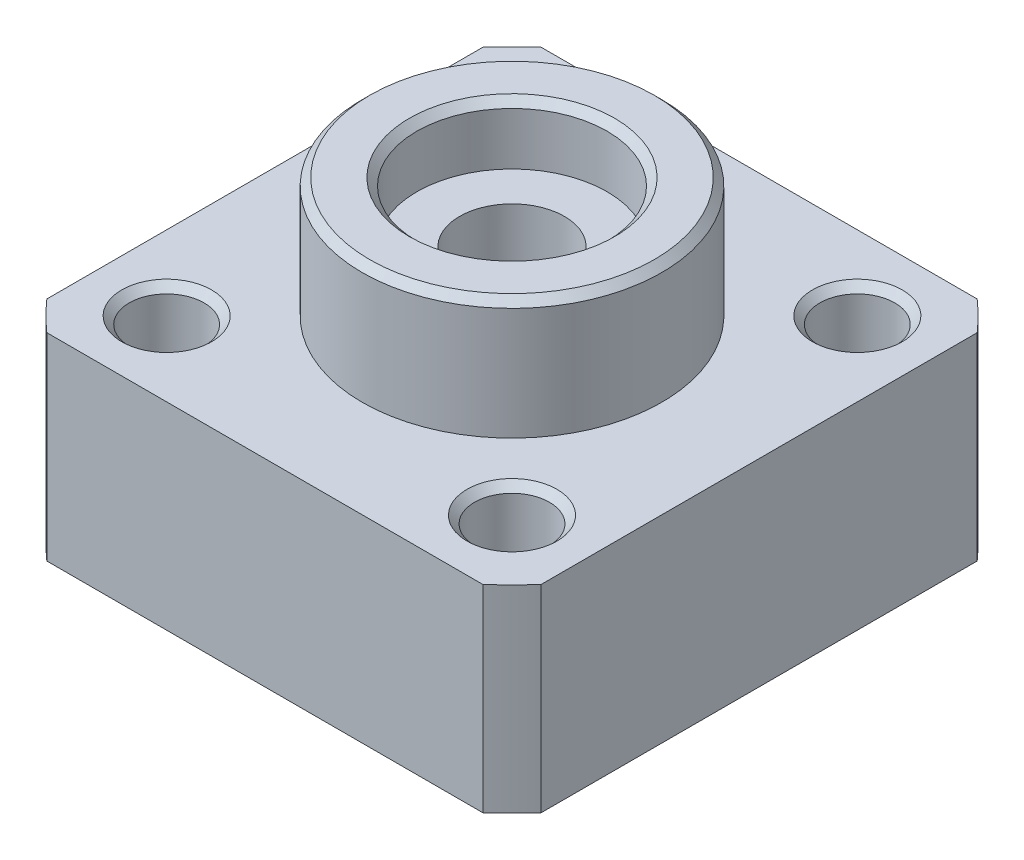
ISO-10303-21;
HEADER;
FILE_DESCRIPTION(('STEP AP214'),'2;1');
FILE_NAME('part.step','',(''),(''),'','','');
FILE_SCHEMA(('AUTOMOTIVE_DESIGN { 1 0 10303 214 1 1 1 1 }'));
ENDSEC;
DATA;
#1=APPLICATION_CONTEXT('core data for automotive mechanical design processes');
#2=APPLICATION_PROTOCOL_DEFINITION('international standard','automotive_design',2000,#1);
#3=PRODUCT_CONTEXT('',#1,'mechanical');
#4=PRODUCT('Part','Part','',(#3));
#5=PRODUCT_RELATED_PRODUCT_CATEGORY('part','',(#4));
#6=PRODUCT_DEFINITION_FORMATION('','',#4);
#7=PRODUCT_DEFINITION_CONTEXT('part definition',#1,'design');
#8=PRODUCT_DEFINITION('design','',#6,#7);
#9=PRODUCT_DEFINITION_SHAPE('','',#8);
#10=(LENGTH_UNIT() NAMED_UNIT(*) SI_UNIT(.MILLI.,.METRE.));
#11=(NAMED_UNIT(*) PLANE_ANGLE_UNIT() SI_UNIT($,.RADIAN.));
#12=(NAMED_UNIT(*) SI_UNIT($,.STERADIAN.) SOLID_ANGLE_UNIT());
#13=UNCERTAINTY_MEASURE_WITH_UNIT(LENGTH_MEASURE(1.E-05),#10,'distance_accuracy_value','');
#14=(GEOMETRIC_REPRESENTATION_CONTEXT(3) GLOBAL_UNCERTAINTY_ASSIGNED_CONTEXT((#13)) GLOBAL_UNIT_ASSIGNED_CONTEXT((#10,
#11,#12)) REPRESENTATION_CONTEXT('',''));
#15=CARTESIAN_POINT('',(0.,0.,0.));
#16=DIRECTION('',(0.,0.,1.));
#17=DIRECTION('',(1.,0.,0.));
#18=AXIS2_PLACEMENT_3D('',#15,#16,#17);
#19=CARTESIAN_POINT('',(-22.,13.2,0.));
#20=DIRECTION('',(0.,-1.,0.));
#21=DIRECTION('',(0.,0.,-1.));
#22=AXIS2_PLACEMENT_3D('',#19,#20,#21);
#23=PLANE('',#22);
#24=CARTESIAN_POINT('',(-11.5258405333407,13.2,11.5258405333407));
#25=DIRECTION('',(0.,-1.,0.));
#26=DIRECTION('',(0.,0.,-1.));
#27=AXIS2_PLACEMENT_3D('',#24,#25,#26);
#28=CIRCLE('',#27,3.);
#29=CARTESIAN_POINT('',(-11.5258405333407,13.2,8.52584053334072));
#30=VERTEX_POINT('',#29);
#31=EDGE_CURVE('E306',#30,#30,#28,.T.);
#32=ORIENTED_EDGE('',*,*,#31,.T.);
#33=EDGE_LOOP('',(#32));
#34=FACE_BOUND('',#33,.T.);
#35=CARTESIAN_POINT('',(-11.5258405333407,13.2,-11.5258405333407));
#36=DIRECTION('',(0.,-1.,0.));
#37=DIRECTION('',(0.,0.,-1.));
#38=AXIS2_PLACEMENT_3D('',#35,#36,#37);
#39=CIRCLE('',#38,3.);
#40=CARTESIAN_POINT('',(-11.5258405333407,13.2,-14.5258405333407));
#41=VERTEX_POINT('',#40);
#42=EDGE_CURVE('E308',#41,#41,#39,.T.);
#43=ORIENTED_EDGE('',*,*,#42,.T.);
#44=EDGE_LOOP('',(#43));
#45=FACE_BOUND('',#44,.T.);
#46=CARTESIAN_POINT('',(11.5258405333407,13.2,-11.5258405333407));
#47=DIRECTION('',(0.,-1.,0.));
#48=DIRECTION('',(0.,0.,-1.));
#49=AXIS2_PLACEMENT_3D('',#46,#47,#48);
#50=CIRCLE('',#49,3.);
#51=CARTESIAN_POINT('',(11.5258405333407,13.2,-14.5258405333407));
#52=VERTEX_POINT('',#51);
#53=EDGE_CURVE('E311',#52,#52,#50,.T.);
#54=ORIENTED_EDGE('',*,*,#53,.T.);
#55=EDGE_LOOP('',(#54));
#56=FACE_BOUND('',#55,.T.);
#57=CARTESIAN_POINT('',(11.5258405333407,13.2,11.5258405333407));
#58=DIRECTION('',(0.,-1.,0.));
#59=DIRECTION('',(0.,0.,-1.));
#60=AXIS2_PLACEMENT_3D('',#57,#58,#59);
#61=CIRCLE('',#60,3.);
#62=CARTESIAN_POINT('',(11.5258405333407,13.2,8.52584053334072));
#63=VERTEX_POINT('',#62);
#64=EDGE_CURVE('E314',#63,#63,#61,.T.);
#65=ORIENTED_EDGE('',*,*,#64,.T.);
#66=EDGE_LOOP('',(#65));
#67=FACE_BOUND('',#66,.T.);
#68=CARTESIAN_POINT('',(0.,13.2,0.));
#69=DIRECTION('',(0.,-1.,0.));
#70=DIRECTION('',(0.,0.,-1.));
#71=AXIS2_PLACEMENT_3D('',#68,#69,#70);
#72=CIRCLE('',#71,10.);
#73=CARTESIAN_POINT('',(0.,13.2,-10.));
#74=VERTEX_POINT('',#73);
#75=EDGE_CURVE('E114',#74,#74,#72,.T.);
#76=ORIENTED_EDGE('',*,*,#75,.T.);
#77=EDGE_LOOP('',(#76));
#78=FACE_BOUND('',#77,.T.);
#79=DIRECTION('',(0.,0.,-1.));
#80=VECTOR('',#79,1.);
#81=CARTESIAN_POINT('',(-16.5,13.2,0.));
#82=LINE('',#81,#80);
#83=CARTESIAN_POINT('',(-16.5,13.2,14.5516322108553));
#84=VERTEX_POINT('',#83);
#85=CARTESIAN_POINT('',(-16.5,13.2,-14.5516322108553));
#86=VERTEX_POINT('',#85);
#87=EDGE_CURVE('E165',#84,#86,#82,.T.);
#88=ORIENTED_EDGE('',*,*,#87,.F.);
#89=CARTESIAN_POINT('',(0.,13.2,0.));
#90=DIRECTION('',(0.,-1.,0.));
#91=DIRECTION('',(0.,0.,-1.));
#92=AXIS2_PLACEMENT_3D('',#89,#90,#91);
#93=CIRCLE('',#92,22.);
#94=CARTESIAN_POINT('',(-14.5516322108552,13.2,16.5));
#95=VERTEX_POINT('',#94);
#96=EDGE_CURVE('E139',#95,#84,#93,.T.);
#97=ORIENTED_EDGE('',*,*,#96,.F.);
#98=DIRECTION('',(-1.,0.,0.));
#99=VECTOR('',#98,1.);
#100=CARTESIAN_POINT('',(-22.,13.2,16.5));
#101=LINE('',#100,#99);
#102=CARTESIAN_POINT('',(14.5516322108552,13.2,16.5));
#103=VERTEX_POINT('',#102);
#104=EDGE_CURVE('E155',#103,#95,#101,.T.);
#105=ORIENTED_EDGE('',*,*,#104,.F.);
#106=CARTESIAN_POINT('',(16.5,13.2,14.5516322108552));
#107=VERTEX_POINT('',#106);
#108=EDGE_CURVE('E153',#107,#103,#93,.T.);
#109=ORIENTED_EDGE('',*,*,#108,.F.);
#110=DIRECTION('',(0.,0.,1.));
#111=VECTOR('',#110,1.);
#112=CARTESIAN_POINT('',(16.5,13.2,0.));
#113=LINE('',#112,#111);
#114=CARTESIAN_POINT('',(16.5,13.2,-14.5516322108552));
#115=VERTEX_POINT('',#114);
#116=EDGE_CURVE('E158',#115,#107,#113,.T.);
#117=ORIENTED_EDGE('',*,*,#116,.F.);
#118=CARTESIAN_POINT('',(14.5516322108552,13.2,-16.5));
#119=VERTEX_POINT('',#118);
#120=EDGE_CURVE('E140',#119,#115,#93,.T.);
#121=ORIENTED_EDGE('',*,*,#120,.F.);
#122=DIRECTION('',(1.,0.,0.));
#123=VECTOR('',#122,1.);
#124=CARTESIAN_POINT('',(-22.,13.2,-16.5));
#125=LINE('',#124,#123);
#126=CARTESIAN_POINT('',(-14.5516322108552,13.2,-16.5));
#127=VERTEX_POINT('',#126);
#128=EDGE_CURVE('E123',#127,#119,#125,.T.);
#129=ORIENTED_EDGE('',*,*,#128,.F.);
#130=EDGE_CURVE('E122',#86,#127,#93,.T.);
#131=ORIENTED_EDGE('',*,*,#130,.F.);
#132=EDGE_LOOP('',(#88,#97,#105,#109,#117,#121,#129,#131));
#133=FACE_BOUND('',#132,.T.);
#134=ADVANCED_FACE('F38',(#34,#45,#56,#67,#78,#133),#23,.F.);
#135=CARTESIAN_POINT('',(0.,0.,0.));
#136=DIRECTION('',(0.,-1.,0.));
#137=DIRECTION('',(0.,0.,-1.));
#138=AXIS2_PLACEMENT_3D('',#135,#136,#137);
#139=CYLINDRICAL_SURFACE('',#138,22.);
#140=DIRECTION('',(0.,-1.,0.));
#141=VECTOR('',#140,1.);
#142=CARTESIAN_POINT('',(-16.5,0.,-14.5516322108553));
#143=LINE('',#142,#141);
#144=CARTESIAN_POINT('',(-16.5,0.,-14.5516322108553));
#145=VERTEX_POINT('',#144);
#146=EDGE_CURVE('E53',#86,#145,#143,.T.);
#147=ORIENTED_EDGE('',*,*,#146,.F.);
#148=ORIENTED_EDGE('',*,*,#130,.T.);
#149=DIRECTION('',(0.,-1.,0.));
#150=VECTOR('',#149,1.);
#151=CARTESIAN_POINT('',(-14.5516322108552,0.,-16.5));
#152=LINE('',#151,#150);
#153=CARTESIAN_POINT('',(-14.5516322108552,0.,-16.5));
#154=VERTEX_POINT('',#153);
#155=EDGE_CURVE('E105',#154,#127,#152,.F.);
#156=ORIENTED_EDGE('',*,*,#155,.F.);
#157=CARTESIAN_POINT('',(0.,0.,0.));
#158=DIRECTION('',(0.,-1.,0.));
#159=DIRECTION('',(0.,0.,-1.));
#160=AXIS2_PLACEMENT_3D('',#157,#158,#159);
#161=CIRCLE('',#160,22.);
#162=EDGE_CURVE('E120',#145,#154,#161,.T.);
#163=ORIENTED_EDGE('',*,*,#162,.F.);
#164=EDGE_LOOP('',(#147,#148,#156,#163));
#165=FACE_BOUND('',#164,.T.);
#166=ADVANCED_FACE('F119',(#165),#139,.T.);
#167=DIRECTION('',(0.,-1.,0.));
#168=VECTOR('',#167,1.);
#169=CARTESIAN_POINT('',(-16.5,0.,14.5516322108553));
#170=LINE('',#169,#168);
#171=CARTESIAN_POINT('',(-16.5,0.,14.5516322108553));
#172=VERTEX_POINT('',#171);
#173=EDGE_CURVE('E163',#172,#84,#170,.F.);
#174=ORIENTED_EDGE('',*,*,#173,.F.);
#175=CARTESIAN_POINT('',(-14.5516322108552,0.,16.5));
#176=VERTEX_POINT('',#175);
#177=EDGE_CURVE('E129',#176,#172,#161,.T.);
#178=ORIENTED_EDGE('',*,*,#177,.F.);
#179=DIRECTION('',(0.,-1.,0.));
#180=VECTOR('',#179,1.);
#181=CARTESIAN_POINT('',(-14.5516322108552,0.,16.5));
#182=LINE('',#181,#180);
#183=EDGE_CURVE('E61',#95,#176,#182,.T.);
#184=ORIENTED_EDGE('',*,*,#183,.F.);
#185=ORIENTED_EDGE('',*,*,#96,.T.);
#186=EDGE_LOOP('',(#174,#178,#184,#185));
#187=FACE_BOUND('',#186,.T.);
#188=ADVANCED_FACE('F199',(#187),#139,.T.);
#189=DIRECTION('',(0.,-1.,0.));
#190=VECTOR('',#189,1.);
#191=CARTESIAN_POINT('',(14.5516322108552,0.,16.5));
#192=LINE('',#191,#190);
#193=CARTESIAN_POINT('',(14.5516322108552,0.,16.5));
#194=VERTEX_POINT('',#193);
#195=EDGE_CURVE('E152',#194,#103,#192,.F.);
#196=ORIENTED_EDGE('',*,*,#195,.F.);
#197=CARTESIAN_POINT('',(16.5,0.,14.5516322108553));
#198=VERTEX_POINT('',#197);
#199=EDGE_CURVE('E133',#198,#194,#161,.T.);
#200=ORIENTED_EDGE('',*,*,#199,.F.);
#201=DIRECTION('',(0.,-1.,0.));
#202=VECTOR('',#201,1.);
#203=CARTESIAN_POINT('',(16.5,0.,14.5516322108552));
#204=LINE('',#203,#202);
#205=EDGE_CURVE('E150',#107,#198,#204,.T.);
#206=ORIENTED_EDGE('',*,*,#205,.F.);
#207=ORIENTED_EDGE('',*,*,#108,.T.);
#208=EDGE_LOOP('',(#196,#200,#206,#207));
#209=FACE_BOUND('',#208,.T.);
#210=ADVANCED_FACE('F148',(#209),#139,.T.);
#211=DIRECTION('',(0.,-1.,0.));
#212=VECTOR('',#211,1.);
#213=CARTESIAN_POINT('',(16.5,0.,-14.5516322108552));
#214=LINE('',#213,#212);
#215=CARTESIAN_POINT('',(16.5,0.,-14.5516322108552));
#216=VERTEX_POINT('',#215);
#217=EDGE_CURVE('E382',#216,#115,#214,.F.);
#218=ORIENTED_EDGE('',*,*,#217,.F.);
#219=CARTESIAN_POINT('',(14.5516322108552,0.,-16.5));
#220=VERTEX_POINT('',#219);
#221=EDGE_CURVE('E132',#220,#216,#161,.T.);
#222=ORIENTED_EDGE('',*,*,#221,.F.);
#223=DIRECTION('',(0.,-1.,0.));
#224=VECTOR('',#223,1.);
#225=CARTESIAN_POINT('',(14.5516322108552,0.,-16.5));
#226=LINE('',#225,#224);
#227=EDGE_CURVE('E108',#119,#220,#226,.T.);
#228=ORIENTED_EDGE('',*,*,#227,.F.);
#229=ORIENTED_EDGE('',*,*,#120,.T.);
#230=EDGE_LOOP('',(#218,#222,#228,#229));
#231=FACE_BOUND('',#230,.T.);
#232=ADVANCED_FACE('F201',(#231),#139,.T.);
#233=CARTESIAN_POINT('',(-3.5,0.,0.));
#234=DIRECTION('',(0.,1.,0.));
#235=DIRECTION('',(0.,0.,1.));
#236=AXIS2_PLACEMENT_3D('',#233,#234,#235);
#237=PLANE('',#236);
#238=CARTESIAN_POINT('',(-11.5258405333407,0.,11.5258405333407));
#239=DIRECTION('',(0.,1.,0.));
#240=DIRECTION('',(0.,0.,1.));
#241=AXIS2_PLACEMENT_3D('',#238,#239,#240);
#242=CIRCLE('',#241,3.);
#243=CARTESIAN_POINT('',(-11.5258405333407,0.,14.5258405333407));
#244=VERTEX_POINT('',#243);
#245=EDGE_CURVE('E285',#244,#244,#242,.T.);
#246=ORIENTED_EDGE('',*,*,#245,.T.);
#247=EDGE_LOOP('',(#246));
#248=FACE_BOUND('',#247,.T.);
#249=CARTESIAN_POINT('',(-11.5258405333407,0.,-11.5258405333407));
#250=DIRECTION('',(0.,1.,0.));
#251=DIRECTION('',(0.,0.,1.));
#252=AXIS2_PLACEMENT_3D('',#249,#250,#251);
#253=CIRCLE('',#252,3.00000000000002);
#254=CARTESIAN_POINT('',(-11.5258405333407,0.,-8.52584053334071));
#255=VERTEX_POINT('',#254);
#256=EDGE_CURVE('E288',#255,#255,#253,.T.);
#257=ORIENTED_EDGE('',*,*,#256,.T.);
#258=EDGE_LOOP('',(#257));
#259=FACE_BOUND('',#258,.T.);
#260=CARTESIAN_POINT('',(11.5258405333407,0.,-11.5258405333407));
#261=DIRECTION('',(0.,1.,0.));
#262=DIRECTION('',(0.,0.,1.));
#263=AXIS2_PLACEMENT_3D('',#260,#261,#262);
#264=CIRCLE('',#263,3.00000000000002);
#265=CARTESIAN_POINT('',(11.5258405333407,0.,-8.52584053334071));
#266=VERTEX_POINT('',#265);
#267=EDGE_CURVE('E291',#266,#266,#264,.T.);
#268=ORIENTED_EDGE('',*,*,#267,.T.);
#269=EDGE_LOOP('',(#268));
#270=FACE_BOUND('',#269,.T.);
#271=CARTESIAN_POINT('',(11.5258405333407,0.,11.5258405333407));
#272=DIRECTION('',(0.,1.,0.));
#273=DIRECTION('',(0.,0.,1.));
#274=AXIS2_PLACEMENT_3D('',#271,#272,#273);
#275=CIRCLE('',#274,3.);
#276=CARTESIAN_POINT('',(11.5258405333407,0.,14.5258405333407));
#277=VERTEX_POINT('',#276);
#278=EDGE_CURVE('E294',#277,#277,#275,.T.);
#279=ORIENTED_EDGE('',*,*,#278,.T.);
#280=EDGE_LOOP('',(#279));
#281=FACE_BOUND('',#280,.T.);
#282=CARTESIAN_POINT('',(0.,0.,0.));
#283=DIRECTION('',(0.,1.,0.));
#284=DIRECTION('',(0.,0.,1.));
#285=AXIS2_PLACEMENT_3D('',#282,#283,#284);
#286=CIRCLE('',#285,4.);
#287=CARTESIAN_POINT('',(0.,0.,4.));
#288=VERTEX_POINT('',#287);
#289=EDGE_CURVE('E297',#288,#288,#286,.T.);
#290=ORIENTED_EDGE('',*,*,#289,.T.);
#291=EDGE_LOOP('',(#290));
#292=FACE_BOUND('',#291,.T.);
#293=DIRECTION('',(0.,0.,1.));
#294=VECTOR('',#293,1.);
#295=CARTESIAN_POINT('',(-16.5,0.,0.));
#296=LINE('',#295,#294);
#297=EDGE_CURVE('E128',#145,#172,#296,.T.);
#298=ORIENTED_EDGE('',*,*,#297,.F.);
#299=ORIENTED_EDGE('',*,*,#162,.T.);
#300=DIRECTION('',(-1.,0.,0.));
#301=VECTOR('',#300,1.);
#302=CARTESIAN_POINT('',(-3.5,0.,-16.5));
#303=LINE('',#302,#301);
#304=EDGE_CURVE('E102',#220,#154,#303,.T.);
#305=ORIENTED_EDGE('',*,*,#304,.F.);
#306=ORIENTED_EDGE('',*,*,#221,.T.);
#307=DIRECTION('',(0.,0.,-1.));
#308=VECTOR('',#307,1.);
#309=CARTESIAN_POINT('',(16.5,0.,0.));
#310=LINE('',#309,#308);
#311=EDGE_CURVE('E113',#198,#216,#310,.T.);
#312=ORIENTED_EDGE('',*,*,#311,.F.);
#313=ORIENTED_EDGE('',*,*,#199,.T.);
#314=DIRECTION('',(1.,0.,0.));
#315=VECTOR('',#314,1.);
#316=CARTESIAN_POINT('',(-3.5,0.,16.5));
#317=LINE('',#316,#315);
#318=EDGE_CURVE('E143',#176,#194,#317,.T.);
#319=ORIENTED_EDGE('',*,*,#318,.F.);
#320=ORIENTED_EDGE('',*,*,#177,.T.);
#321=EDGE_LOOP('',(#298,#299,#305,#306,#312,#313,#319,#320));
#322=FACE_BOUND('',#321,.T.);
#323=ADVANCED_FACE('F126',(#248,#259,#270,#281,#292,#322),#237,.F.);
#324=CARTESIAN_POINT('',(0.,0.,0.));
#325=DIRECTION('',(0.,-1.,0.));
#326=DIRECTION('',(0.,0.,-1.));
#327=AXIS2_PLACEMENT_3D('',#324,#325,#326);
#328=CYLINDRICAL_SURFACE('',#327,6.35);
#329=CARTESIAN_POINT('',(0.,20.7,0.));
#330=DIRECTION('',(0.,-1.,0.));
#331=DIRECTION('',(0.,0.,-1.));
#332=AXIS2_PLACEMENT_3D('',#329,#330,#331);
#333=CIRCLE('',#332,6.35);
#334=CARTESIAN_POINT('',(0.,20.7,-6.35));
#335=VERTEX_POINT('',#334);
#336=EDGE_CURVE('E46',#335,#335,#333,.F.);
#337=ORIENTED_EDGE('',*,*,#336,.T.);
#338=EDGE_LOOP('',(#337));
#339=FACE_BOUND('',#338,.T.);
#340=CARTESIAN_POINT('',(0.,17.2,0.));
#341=DIRECTION('',(0.,-1.,0.));
#342=DIRECTION('',(0.,0.,-1.));
#343=AXIS2_PLACEMENT_3D('',#340,#341,#342);
#344=CIRCLE('',#343,6.35);
#345=CARTESIAN_POINT('',(0.,17.2,-6.35));
#346=VERTEX_POINT('',#345);
#347=EDGE_CURVE('E135',#346,#346,#344,.T.);
#348=ORIENTED_EDGE('',*,*,#347,.T.);
#349=EDGE_LOOP('',(#348));
#350=FACE_BOUND('',#349,.T.);
#351=ADVANCED_FACE('F171',(#339,#350),#328,.F.);
#352=CARTESIAN_POINT('',(-10.,21.2,0.));
#353=DIRECTION('',(0.,-1.,0.));
#354=DIRECTION('',(0.,0.,-1.));
#355=AXIS2_PLACEMENT_3D('',#352,#353,#354);
#356=PLANE('',#355);
#357=CARTESIAN_POINT('',(0.,21.2,0.));
#358=DIRECTION('',(0.,-1.,0.));
#359=DIRECTION('',(0.,0.,-1.));
#360=AXIS2_PLACEMENT_3D('',#357,#358,#359);
#361=CIRCLE('',#360,6.85);
#362=CARTESIAN_POINT('',(0.,21.2,-6.85));
#363=VERTEX_POINT('',#362);
#364=EDGE_CURVE('E259',#363,#363,#361,.T.);
#365=ORIENTED_EDGE('',*,*,#364,.T.);
#366=EDGE_LOOP('',(#365));
#367=FACE_BOUND('',#366,.T.);
#368=CARTESIAN_POINT('',(0.,21.2,0.));
#369=DIRECTION('',(0.,-1.,0.));
#370=DIRECTION('',(0.,0.,-1.));
#371=AXIS2_PLACEMENT_3D('',#368,#369,#370);
#372=CIRCLE('',#371,9.49999999999999);
#373=CARTESIAN_POINT('',(0.,21.2,-9.49999999999999));
#374=VERTEX_POINT('',#373);
#375=EDGE_CURVE('E260',#374,#374,#372,.F.);
#376=ORIENTED_EDGE('',*,*,#375,.T.);
#377=EDGE_LOOP('',(#376));
#378=FACE_BOUND('',#377,.T.);
#379=ADVANCED_FACE('F187',(#367,#378),#356,.F.);
#380=CARTESIAN_POINT('',(0.,0.,0.));
#381=DIRECTION('',(0.,-1.,0.));
#382=DIRECTION('',(0.,0.,-1.));
#383=AXIS2_PLACEMENT_3D('',#380,#381,#382);
#384=CYLINDRICAL_SURFACE('',#383,10.);
#385=CARTESIAN_POINT('',(0.,20.7,0.));
#386=DIRECTION('',(0.,-1.,0.));
#387=DIRECTION('',(0.,0.,-1.));
#388=AXIS2_PLACEMENT_3D('',#385,#386,#387);
#389=CIRCLE('',#388,10.);
#390=CARTESIAN_POINT('',(0.,20.7,-10.));
#391=VERTEX_POINT('',#390);
#392=EDGE_CURVE('E11',#391,#391,#389,.T.);
#393=ORIENTED_EDGE('',*,*,#392,.T.);
#394=EDGE_LOOP('',(#393));
#395=FACE_BOUND('',#394,.T.);
#396=ORIENTED_EDGE('',*,*,#75,.F.);
#397=EDGE_LOOP('',(#396));
#398=FACE_BOUND('',#397,.T.);
#399=ADVANCED_FACE('F181',(#395,#398),#384,.T.);
#400=CARTESIAN_POINT('',(0.,0.,0.));
#401=DIRECTION('',(0.,-1.,0.));
#402=DIRECTION('',(0.,0.,-1.));
#403=AXIS2_PLACEMENT_3D('',#400,#401,#402);
#404=CYLINDRICAL_SURFACE('',#403,3.5);
#405=CARTESIAN_POINT('',(0.,0.499999999999996,0.));
#406=DIRECTION('',(0.,1.,0.));
#407=DIRECTION('',(0.,0.,1.));
#408=AXIS2_PLACEMENT_3D('',#405,#406,#407);
#409=CIRCLE('',#408,3.5);
#410=CARTESIAN_POINT('',(0.,0.499999999999996,3.5));
#411=VERTEX_POINT('',#410);
#412=EDGE_CURVE('E263',#411,#411,#409,.F.);
#413=ORIENTED_EDGE('',*,*,#412,.T.);
#414=EDGE_LOOP('',(#413));
#415=FACE_BOUND('',#414,.T.);
#416=CARTESIAN_POINT('',(-2.,6.6,-2.87228132326901));
#417=CARTESIAN_POINT('',(-1.99999795577564,6.49824071697676,-2.87228454712099));
#418=CARTESIAN_POINT('',(-1.99218519270229,6.39646672831802,-2.87777067623112));
#419=CARTESIAN_POINT('',(-1.96144931078719,6.19626540463563,-2.89880046688831));
#420=CARTESIAN_POINT('',(-1.938510080698,6.09784175574433,-2.91435485184119));
#421=CARTESIAN_POINT('',(-1.87896057653214,5.90762149928021,-2.95309076236742));
#422=CARTESIAN_POINT('',(-1.84243903117341,5.81578639695527,-2.97622267211548));
#423=CARTESIAN_POINT('',(-1.75704253677619,5.63958400081872,-3.02742059167266));
#424=CARTESIAN_POINT('',(-1.7081636279035,5.55521911251005,-3.05548818220821));
#425=CARTESIAN_POINT('',(-1.59317521338083,5.3861806587717,-3.11712928824724));
#426=CARTESIAN_POINT('',(-1.5257632071111,5.30248993469339,-3.15096898375113));
#427=CARTESIAN_POINT('',(-1.37830388138079,5.14680209211825,-3.21820634481925));
#428=CARTESIAN_POINT('',(-1.2982484020457,5.07481258668842,-3.25160370971936));
#429=CARTESIAN_POINT('',(-1.11854160271473,4.93783291507044,-3.31796239643438));
#430=CARTESIAN_POINT('',(-1.01775177832643,4.87415457176006,-3.35058180751117));
#431=CARTESIAN_POINT('',(-0.804671960588808,4.76511913000374,-3.40802542898886));
#432=CARTESIAN_POINT('',(-0.692391570313776,4.71974688674696,-3.43285607930473));
#433=CARTESIAN_POINT('',(-0.470016279358692,4.6528618996064,-3.46996336372305));
#434=CARTESIAN_POINT('',(-0.360605805974551,4.62959435836294,-3.48315582593062));
#435=CARTESIAN_POINT('',(-0.13871371211624,4.60169299604949,-3.49901289726841));
#436=CARTESIAN_POINT('',(-0.0262347176938128,4.5970437157211,-3.50168624068257));
#437=CARTESIAN_POINT('',(0.184946963787595,4.60608689983999,-3.49652510240883));
#438=CARTESIAN_POINT('',(0.283772577167377,4.61776975643836,-3.48984178265963));
#439=CARTESIAN_POINT('',(0.477779282721359,4.65539452444678,-3.46860910566489));
#440=CARTESIAN_POINT('',(0.572960106226071,4.6813374848602,-3.45405916973575));
#441=CARTESIAN_POINT('',(0.75817849675909,4.74665099229667,-3.41820908135194));
#442=CARTESIAN_POINT('',(0.84816287736819,4.7861387474121,-3.39685012587018));
#443=CARTESIAN_POINT('',(1.02037827753867,4.87711784116995,-3.34915268765434));
#444=CARTESIAN_POINT('',(1.10260700085174,4.92861271923772,-3.3228127370703));
#445=CARTESIAN_POINT('',(1.26692918495856,5.04874592127863,-3.26394555274581));
#446=CARTESIAN_POINT('',(1.34795656029944,5.1186641582258,-3.23105548059221));
#447=CARTESIAN_POINT('',(1.49778980682765,5.27033465934113,-3.16439037140551));
#448=CARTESIAN_POINT('',(1.56658064643715,5.35210125765267,-3.13061430362079));
#449=CARTESIAN_POINT('',(1.69686219905414,5.53488022288358,-3.06212243151114));
#450=CARTESIAN_POINT('',(1.75694261459508,5.63699844156409,-3.02764831081433));
#451=CARTESIAN_POINT('',(1.85868169503534,5.85207752591313,-2.96628701949477));
#452=CARTESIAN_POINT('',(1.90037300071843,5.96501874323717,-2.93938643675613));
#453=CARTESIAN_POINT('',(1.955874001455,6.17190959062671,-2.90265362950898));
#454=CARTESIAN_POINT('',(1.97388069289566,6.26429134217346,-2.89032428676995));
#455=CARTESIAN_POINT('',(1.99669026146642,6.45138817084493,-2.87461858134697));
#456=CARTESIAN_POINT('',(2.00150579796718,6.54610092278013,-2.87123363495883));
#457=CARTESIAN_POINT('',(1.99766863089417,6.73516343212115,-2.87390377719122));
#458=CARTESIAN_POINT('',(1.98900796355997,6.82951294183306,-2.87996444770089));
#459=CARTESIAN_POINT('',(1.95870152807444,7.01514959645773,-2.90065746980172));
#460=CARTESIAN_POINT('',(1.93704629977864,7.10643445910858,-2.91529606600907));
#461=CARTESIAN_POINT('',(1.88140846842958,7.28495328166673,-2.95150911798997));
#462=CARTESIAN_POINT('',(1.84727488278457,7.37212219472485,-2.97316813748298));
#463=CARTESIAN_POINT('',(1.7678570298669,7.5398419588285,-3.02106419530221));
#464=CARTESIAN_POINT('',(1.7225682138661,7.62039009222811,-3.04730309987681));
#465=CARTESIAN_POINT('',(1.61341400894957,7.78674731846636,-3.10666399761926));
#466=CARTESIAN_POINT('',(1.547711996041,7.87120471486998,-3.14020508074668));
#467=CARTESIAN_POINT('',(1.40365915117369,8.02868572125833,-3.20718874482692));
#468=CARTESIAN_POINT('',(1.32529785443659,8.10169977238414,-3.2406312207748));
#469=CARTESIAN_POINT('',(1.14867494696647,8.24147873905662,-3.30761562311545));
#470=CARTESIAN_POINT('',(1.04920745926284,8.30689126341776,-3.34083391107344));
#471=CARTESIAN_POINT('',(0.838502048903106,8.41965844723343,-3.39983021540636));
#472=CARTESIAN_POINT('',(0.727273517759581,8.46702737792577,-3.42561410793537));
#473=CARTESIAN_POINT('',(0.505697568225678,8.53821642470346,-3.46494999115132));
#474=CARTESIAN_POINT('',(0.396016146177116,8.56364021417987,-3.47932715272067));
#475=CARTESIAN_POINT('',(0.17311053252493,8.59566463319743,-3.49749840717713));
#476=CARTESIAN_POINT('',(0.0598895624756789,8.60228190282047,-3.50130185566163));
#477=CARTESIAN_POINT('',(-0.15266344638814,8.59666299303595,-3.49809507365951));
#478=CARTESIAN_POINT('',(-0.252078181064023,8.5865316276306,-3.49229198229475));
#479=CARTESIAN_POINT('',(-0.447516424373181,8.55181414035173,-3.47266080925366));
#480=CARTESIAN_POINT('',(-0.543539754940808,8.52722726068401,-3.45883230686572));
#481=CARTESIAN_POINT('',(-0.729940626918287,8.46463874091232,-3.42435356756848));
#482=CARTESIAN_POINT('',(-0.820308611690861,8.4266150788745,-3.40369213555968));
#483=CARTESIAN_POINT('',(-0.993497634912791,8.33850860831676,-3.35723286822268));
#484=CARTESIAN_POINT('',(-1.07631659934354,8.28842249944241,-3.33143362749563));
#485=CARTESIAN_POINT('',(-1.24182171167628,8.1713852762283,-3.27358852163637));
#486=CARTESIAN_POINT('',(-1.32349322177373,8.1031857172137,-3.24116776373342));
#487=CARTESIAN_POINT('',(-1.47489022304119,7.95496930487775,-3.17514349361031));
#488=CARTESIAN_POINT('',(-1.54460124934942,7.87493835746265,-3.14153860767596));
#489=CARTESIAN_POINT('',(-1.67746044898754,7.69538698398312,-3.07282960146827));
#490=CARTESIAN_POINT('',(-1.73915916121082,7.59470355515741,-3.03793640760435));
#491=CARTESIAN_POINT('',(-1.84444649268112,7.38230817199374,-2.97519675497848));
#492=CARTESIAN_POINT('',(-1.88806476770662,7.27061465210016,-2.94733878651354));
#493=CARTESIAN_POINT('',(-1.94723136203471,7.06572576098034,-2.9084776323925));
#494=CARTESIAN_POINT('',(-1.96692818344741,6.9741836596729,-2.89507162454789));
#495=CARTESIAN_POINT('',(-1.99330737566684,6.78843019166413,-2.87697604487482));
#496=CARTESIAN_POINT('',(-2.00000189279715,6.69422139966692,-2.87227833822591));
#497=CARTESIAN_POINT('',(-2.,6.6,-2.87228132326901));
#498=B_SPLINE_CURVE_WITH_KNOTS('',3,(#416,#417,#418,#419,#420,#421,#422,#423,#424,#425,#426,
#427,#428,#429,#430,#431,#432,#433,#434,#435,#436,#437,#438,#439,#440,#441,#442,#443,#444,#445,
#446,#447,#448,#449,#450,#451,#452,#453,#454,#455,#456,#457,#458,#459,#460,#461,#462,#463,#464,
#465,#466,#467,#468,#469,#470,#471,#472,#473,#474,#475,#476,#477,#478,#479,#480,#481,#482,#483,
#484,#485,#486,#487,#488,#489,#490,#491,#492,#493,#494,#495,#496,#497),.UNSPECIFIED.,.T.,.F.,(4,
2,2,2,2,2,2,2,2,2,2,2,2,2,2,2,2,2,2,2,2,2,2,2,2,2,2,2,2,2,2,2,2,2,2,2,2,2,2,2,4),(0.,
0.304883874922045,0.610093008270222,0.913342368040702,1.21668902547472,1.55333694497106,
1.89020302568347,2.25902542597166,2.62754206720092,2.96347760859663,3.29913415548684,
3.59693222043896,3.89475219497793,4.1952171976663,4.49577088279065,4.83030033345032,
5.16523793001608,5.53354788734201,5.90120143518938,6.18472748221689,6.46798133769669,
6.75140264557764,7.03503053719285,7.32221037238044,7.60950750428142,7.944568532569,
8.27990796934228,8.64873850633052,9.01727671507228,9.35580044793154,9.69402456028397,
9.99288076018055,10.291752628263,10.591116615435,10.8905626035456,11.222913671625,
11.5556638903259,11.9232239861485,12.2901787962962,12.572742293729,12.8550417024667),.UNSPECIFIED.);
#499=CARTESIAN_POINT('',(-2.,6.6,-2.87228132326901));
#500=VERTEX_POINT('',#499);
#501=EDGE_CURVE('E124',#500,#500,#498,.T.);
#502=ORIENTED_EDGE('',*,*,#501,.F.);
#503=EDGE_LOOP('',(#502));
#504=FACE_BOUND('',#503,.T.);
#505=CARTESIAN_POINT('',(0.,17.2,0.));
#506=DIRECTION('',(0.,-1.,0.));
#507=DIRECTION('',(0.,0.,-1.));
#508=AXIS2_PLACEMENT_3D('',#505,#506,#507);
#509=CIRCLE('',#508,3.5);
#510=CARTESIAN_POINT('',(0.,17.2,-3.5));
#511=VERTEX_POINT('',#510);
#512=EDGE_CURVE('E130',#511,#511,#509,.T.);
#513=ORIENTED_EDGE('',*,*,#512,.F.);
#514=EDGE_LOOP('',(#513));
#515=FACE_BOUND('',#514,.T.);
#516=ADVANCED_FACE('F176',(#415,#504,#515),#404,.F.);
#517=CARTESIAN_POINT('',(-6.35,17.2,0.));
#518=DIRECTION('',(0.,-1.,0.));
#519=DIRECTION('',(0.,0.,-1.));
#520=AXIS2_PLACEMENT_3D('',#517,#518,#519);
#521=PLANE('',#520);
#522=ORIENTED_EDGE('',*,*,#347,.F.);
#523=EDGE_LOOP('',(#522));
#524=FACE_BOUND('',#523,.T.);
#525=ORIENTED_EDGE('',*,*,#512,.T.);
#526=EDGE_LOOP('',(#525));
#527=FACE_BOUND('',#526,.T.);
#528=ADVANCED_FACE('F173',(#524,#527),#521,.F.);
#529=CARTESIAN_POINT('',(-16.5,21.2,-16.5));
#530=DIRECTION('',(0.,0.,-1.));
#531=DIRECTION('',(-1.,0.,0.));
#532=AXIS2_PLACEMENT_3D('',#529,#530,#531);
#533=PLANE('',#532);
#534=CARTESIAN_POINT('',(0.,6.6,-16.5));
#535=DIRECTION('',(0.,0.,-1.));
#536=DIRECTION('',(-1.,0.,0.));
#537=AXIS2_PLACEMENT_3D('',#534,#535,#536);
#538=CIRCLE('',#537,4.4);
#539=CARTESIAN_POINT('',(-4.4,6.6,-16.5));
#540=VERTEX_POINT('',#539);
#541=EDGE_CURVE('E600',#540,#540,#538,.T.);
#542=ORIENTED_EDGE('',*,*,#541,.F.);
#543=EDGE_LOOP('',(#542));
#544=FACE_BOUND('',#543,.T.);
#545=ORIENTED_EDGE('',*,*,#227,.T.);
#546=ORIENTED_EDGE('',*,*,#304,.T.);
#547=ORIENTED_EDGE('',*,*,#155,.T.);
#548=ORIENTED_EDGE('',*,*,#128,.T.);
#549=EDGE_LOOP('',(#545,#546,#547,#548));
#550=FACE_BOUND('',#549,.T.);
#551=ADVANCED_FACE('F104',(#544,#550),#533,.T.);
#552=CARTESIAN_POINT('',(16.5,21.2,16.5));
#553=DIRECTION('',(1.,0.,0.));
#554=DIRECTION('',(0.,0.,-1.));
#555=AXIS2_PLACEMENT_3D('',#552,#553,#554);
#556=PLANE('',#555);
#557=ORIENTED_EDGE('',*,*,#205,.T.);
#558=ORIENTED_EDGE('',*,*,#311,.T.);
#559=ORIENTED_EDGE('',*,*,#217,.T.);
#560=ORIENTED_EDGE('',*,*,#116,.T.);
#561=EDGE_LOOP('',(#557,#558,#559,#560));
#562=FACE_BOUND('',#561,.T.);
#563=ADVANCED_FACE('F347',(#562),#556,.T.);
#564=CARTESIAN_POINT('',(-16.5,21.2,16.5));
#565=DIRECTION('',(0.,0.,1.));
#566=DIRECTION('',(1.,0.,0.));
#567=AXIS2_PLACEMENT_3D('',#564,#565,#566);
#568=PLANE('',#567);
#569=ORIENTED_EDGE('',*,*,#183,.T.);
#570=ORIENTED_EDGE('',*,*,#318,.T.);
#571=ORIENTED_EDGE('',*,*,#195,.T.);
#572=ORIENTED_EDGE('',*,*,#104,.T.);
#573=EDGE_LOOP('',(#569,#570,#571,#572));
#574=FACE_BOUND('',#573,.T.);
#575=ADVANCED_FACE('F338',(#574),#568,.T.);
#576=CARTESIAN_POINT('',(-16.5,21.2,16.5));
#577=DIRECTION('',(-1.,0.,0.));
#578=DIRECTION('',(0.,0.,1.));
#579=AXIS2_PLACEMENT_3D('',#576,#577,#578);
#580=PLANE('',#579);
#581=ORIENTED_EDGE('',*,*,#146,.T.);
#582=ORIENTED_EDGE('',*,*,#297,.T.);
#583=ORIENTED_EDGE('',*,*,#173,.T.);
#584=ORIENTED_EDGE('',*,*,#87,.T.);
#585=EDGE_LOOP('',(#581,#582,#583,#584));
#586=FACE_BOUND('',#585,.T.);
#587=ADVANCED_FACE('F335',(#586),#580,.T.);
#588=CARTESIAN_POINT('',(-11.5258405333407,21.2,11.5258405333407));
#589=DIRECTION('',(0.,-1.,0.));
#590=DIRECTION('',(0.,0.,-1.));
#591=AXIS2_PLACEMENT_3D('',#588,#589,#590);
#592=CYLINDRICAL_SURFACE('',#591,2.5);
#593=CARTESIAN_POINT('',(-11.5258405333407,12.7,11.5258405333407));
#594=DIRECTION('',(0.,-1.,0.));
#595=DIRECTION('',(0.,0.,-1.));
#596=AXIS2_PLACEMENT_3D('',#593,#594,#595);
#597=CIRCLE('',#596,2.5);
#598=CARTESIAN_POINT('',(-11.5258405333407,12.7,9.02584053334073));
#599=VERTEX_POINT('',#598);
#600=EDGE_CURVE('E300',#599,#599,#597,.F.);
#601=ORIENTED_EDGE('',*,*,#600,.T.);
#602=EDGE_LOOP('',(#601));
#603=FACE_BOUND('',#602,.T.);
#604=CARTESIAN_POINT('',(-11.5258405333407,0.49999999999999,11.5258405333407));
#605=DIRECTION('',(0.,1.,0.));
#606=DIRECTION('',(0.,0.,1.));
#607=AXIS2_PLACEMENT_3D('',#604,#605,#606);
#608=CIRCLE('',#607,2.5);
#609=CARTESIAN_POINT('',(-11.5258405333407,0.49999999999999,14.0258405333407));
#610=VERTEX_POINT('',#609);
#611=EDGE_CURVE('E303',#610,#610,#608,.F.);
#612=ORIENTED_EDGE('',*,*,#611,.T.);
#613=EDGE_LOOP('',(#612));
#614=FACE_BOUND('',#613,.T.);
#615=ADVANCED_FACE('F337',(#603,#614),#592,.F.);
#616=CARTESIAN_POINT('',(11.5258405333407,21.2,-11.5258405333407));
#617=DIRECTION('',(0.,-1.,0.));
#618=DIRECTION('',(0.,0.,-1.));
#619=AXIS2_PLACEMENT_3D('',#616,#617,#618);
#620=CYLINDRICAL_SURFACE('',#619,2.5);
#621=CARTESIAN_POINT('',(11.5258405333407,12.7,-11.5258405333407));
#622=DIRECTION('',(0.,-1.,0.));
#623=DIRECTION('',(0.,0.,-1.));
#624=AXIS2_PLACEMENT_3D('',#621,#622,#623);
#625=CIRCLE('',#624,2.5);
#626=CARTESIAN_POINT('',(11.5258405333407,12.7,-14.0258405333407));
#627=VERTEX_POINT('',#626);
#628=EDGE_CURVE('E273',#627,#627,#625,.F.);
#629=ORIENTED_EDGE('',*,*,#628,.T.);
#630=EDGE_LOOP('',(#629));
#631=FACE_BOUND('',#630,.T.);
#632=CARTESIAN_POINT('',(11.5258405333407,0.500000000000011,-11.5258405333407));
#633=DIRECTION('',(0.,1.,0.));
#634=DIRECTION('',(0.,0.,1.));
#635=AXIS2_PLACEMENT_3D('',#632,#633,#634);
#636=CIRCLE('',#635,2.5);
#637=CARTESIAN_POINT('',(11.5258405333407,0.500000000000011,-9.02584053334073));
#638=VERTEX_POINT('',#637);
#639=EDGE_CURVE('E276',#638,#638,#636,.F.);
#640=ORIENTED_EDGE('',*,*,#639,.T.);
#641=EDGE_LOOP('',(#640));
#642=FACE_BOUND('',#641,.T.);
#643=ADVANCED_FACE('F344',(#631,#642),#620,.F.);
#644=CARTESIAN_POINT('',(11.5258405333407,21.2,11.5258405333407));
#645=DIRECTION('',(0.,-1.,0.));
#646=DIRECTION('',(0.,0.,-1.));
#647=AXIS2_PLACEMENT_3D('',#644,#645,#646);
#648=CYLINDRICAL_SURFACE('',#647,2.5);
#649=CARTESIAN_POINT('',(11.5258405333407,12.7,11.5258405333407));
#650=DIRECTION('',(0.,-1.,0.));
#651=DIRECTION('',(0.,0.,-1.));
#652=AXIS2_PLACEMENT_3D('',#649,#650,#651);
#653=CIRCLE('',#652,2.5);
#654=CARTESIAN_POINT('',(11.5258405333407,12.7,9.02584053334073));
#655=VERTEX_POINT('',#654);
#656=EDGE_CURVE('E267',#655,#655,#653,.F.);
#657=ORIENTED_EDGE('',*,*,#656,.T.);
#658=EDGE_LOOP('',(#657));
#659=FACE_BOUND('',#658,.T.);
#660=CARTESIAN_POINT('',(11.5258405333407,0.49999999999999,11.5258405333407));
#661=DIRECTION('',(0.,1.,0.));
#662=DIRECTION('',(0.,0.,1.));
#663=AXIS2_PLACEMENT_3D('',#660,#661,#662);
#664=CIRCLE('',#663,2.5);
#665=CARTESIAN_POINT('',(11.5258405333407,0.49999999999999,14.0258405333407));
#666=VERTEX_POINT('',#665);
#667=EDGE_CURVE('E270',#666,#666,#664,.F.);
#668=ORIENTED_EDGE('',*,*,#667,.T.);
#669=EDGE_LOOP('',(#668));
#670=FACE_BOUND('',#669,.T.);
#671=ADVANCED_FACE('F356',(#659,#670),#648,.F.);
#672=CARTESIAN_POINT('',(-11.5258405333407,21.2,-11.5258405333407));
#673=DIRECTION('',(0.,-1.,0.));
#674=DIRECTION('',(0.,0.,-1.));
#675=AXIS2_PLACEMENT_3D('',#672,#673,#674);
#676=CYLINDRICAL_SURFACE('',#675,2.5);
#677=CARTESIAN_POINT('',(-11.5258405333407,12.7,-11.5258405333407));
#678=DIRECTION('',(0.,-1.,0.));
#679=DIRECTION('',(0.,0.,-1.));
#680=AXIS2_PLACEMENT_3D('',#677,#678,#679);
#681=CIRCLE('',#680,2.5);
#682=CARTESIAN_POINT('',(-11.5258405333407,12.7,-14.0258405333407));
#683=VERTEX_POINT('',#682);
#684=EDGE_CURVE('E279',#683,#683,#681,.F.);
#685=ORIENTED_EDGE('',*,*,#684,.T.);
#686=EDGE_LOOP('',(#685));
#687=FACE_BOUND('',#686,.T.);
#688=CARTESIAN_POINT('',(-11.5258405333407,0.500000000000011,-11.5258405333407));
#689=DIRECTION('',(0.,1.,0.));
#690=DIRECTION('',(0.,0.,1.));
#691=AXIS2_PLACEMENT_3D('',#688,#689,#690);
#692=CIRCLE('',#691,2.5);
#693=CARTESIAN_POINT('',(-11.5258405333407,0.500000000000011,-9.02584053334073));
#694=VERTEX_POINT('',#693);
#695=EDGE_CURVE('E282',#694,#694,#692,.F.);
#696=ORIENTED_EDGE('',*,*,#695,.T.);
#697=EDGE_LOOP('',(#696));
#698=FACE_BOUND('',#697,.T.);
#699=ADVANCED_FACE('F359',(#687,#698),#676,.F.);
#700=CARTESIAN_POINT('',(0.,6.6,16.501));
#701=DIRECTION('',(0.,0.,-1.));
#702=DIRECTION('',(-1.,0.,0.));
#703=AXIS2_PLACEMENT_3D('',#700,#701,#702);
#704=CYLINDRICAL_SURFACE('',#703,2.);
#705=CARTESIAN_POINT('',(0.,6.6,-5.70172123805512));
#706=DIRECTION('',(0.,0.,-1.));
#707=DIRECTION('',(-1.,0.,0.));
#708=AXIS2_PLACEMENT_3D('',#705,#706,#707);
#709=CIRCLE('',#708,2.);
#710=CARTESIAN_POINT('',(-2.,6.6,-5.70172123805512));
#711=VERTEX_POINT('',#710);
#712=EDGE_CURVE('E317',#711,#711,#709,.T.);
#713=ORIENTED_EDGE('',*,*,#712,.T.);
#714=EDGE_LOOP('',(#713));
#715=FACE_BOUND('',#714,.T.);
#716=ORIENTED_EDGE('',*,*,#501,.T.);
#717=EDGE_LOOP('',(#716));
#718=FACE_BOUND('',#717,.T.);
#719=ADVANCED_FACE('F363',(#715,#718),#704,.F.);
#720=CARTESIAN_POINT('',(0.,6.6,-7.14378672372127));
#721=DIRECTION('',(0.,0.,-1.));
#722=DIRECTION('',(-1.,0.,0.));
#723=AXIS2_PLACEMENT_3D('',#720,#721,#722);
#724=CONICAL_SURFACE('',#723,4.4,1.02974425867665);
#725=CARTESIAN_POINT('',(0.,6.6,-7.14378672372127));
#726=DIRECTION('',(0.,0.,-1.));
#727=DIRECTION('',(-1.,0.,0.));
#728=AXIS2_PLACEMENT_3D('',#725,#726,#727);
#729=CIRCLE('',#728,4.4);
#730=CARTESIAN_POINT('',(-4.4,6.6,-7.14378672372127));
#731=VERTEX_POINT('',#730);
#732=EDGE_CURVE('E320',#731,#731,#729,.T.);
#733=ORIENTED_EDGE('',*,*,#732,.T.);
#734=EDGE_LOOP('',(#733));
#735=FACE_BOUND('',#734,.T.);
#736=ORIENTED_EDGE('',*,*,#712,.F.);
#737=EDGE_LOOP('',(#736));
#738=FACE_BOUND('',#737,.T.);
#739=ADVANCED_FACE('F444',(#735,#738),#724,.F.);
#740=CARTESIAN_POINT('',(0.,6.6,-16.5));
#741=DIRECTION('',(0.,0.,-1.));
#742=DIRECTION('',(-1.,0.,0.));
#743=AXIS2_PLACEMENT_3D('',#740,#741,#742);
#744=CYLINDRICAL_SURFACE('',#743,4.4);
#745=ORIENTED_EDGE('',*,*,#732,.F.);
#746=EDGE_LOOP('',(#745));
#747=FACE_BOUND('',#746,.T.);
#748=ORIENTED_EDGE('',*,*,#541,.T.);
#749=EDGE_LOOP('',(#748));
#750=FACE_BOUND('',#749,.T.);
#751=ADVANCED_FACE('F215',(#747,#750),#744,.F.);
#752=CARTESIAN_POINT('',(-11.5258405333407,13.2,11.5258405333407));
#753=DIRECTION('',(0.,1.,0.));
#754=DIRECTION('',(0.,0.,1.));
#755=AXIS2_PLACEMENT_3D('',#752,#753,#754);
#756=CONICAL_SURFACE('',#755,3.,0.78539816339745);
#757=ORIENTED_EDGE('',*,*,#600,.F.);
#758=EDGE_LOOP('',(#757));
#759=FACE_BOUND('',#758,.T.);
#760=ORIENTED_EDGE('',*,*,#31,.F.);
#761=EDGE_LOOP('',(#760));
#762=FACE_BOUND('',#761,.T.);
#763=ADVANCED_FACE('F211',(#759,#762),#756,.F.);
#764=CARTESIAN_POINT('',(-11.5258405333407,0.49999999999999,11.5258405333407));
#765=DIRECTION('',(0.,-1.,0.));
#766=DIRECTION('',(0.,0.,-1.));
#767=AXIS2_PLACEMENT_3D('',#764,#765,#766);
#768=CONICAL_SURFACE('',#767,2.5,0.785398163397454);
#769=ORIENTED_EDGE('',*,*,#245,.F.);
#770=EDGE_LOOP('',(#769));
#771=FACE_BOUND('',#770,.T.);
#772=ORIENTED_EDGE('',*,*,#611,.F.);
#773=EDGE_LOOP('',(#772));
#774=FACE_BOUND('',#773,.T.);
#775=ADVANCED_FACE('F214',(#771,#774),#768,.F.);
#776=CARTESIAN_POINT('',(-11.5258405333407,13.2,-11.5258405333407));
#777=DIRECTION('',(0.,1.,0.));
#778=DIRECTION('',(0.,0.,1.));
#779=AXIS2_PLACEMENT_3D('',#776,#777,#778);
#780=CONICAL_SURFACE('',#779,3.,0.78539816339745);
#781=ORIENTED_EDGE('',*,*,#684,.F.);
#782=EDGE_LOOP('',(#781));
#783=FACE_BOUND('',#782,.T.);
#784=ORIENTED_EDGE('',*,*,#42,.F.);
#785=EDGE_LOOP('',(#784));
#786=FACE_BOUND('',#785,.T.);
#787=ADVANCED_FACE('F219',(#783,#786),#780,.F.);
#788=CARTESIAN_POINT('',(-11.5258405333407,0.500000000000011,-11.5258405333407));
#789=DIRECTION('',(0.,-1.,0.));
#790=DIRECTION('',(0.,0.,-1.));
#791=AXIS2_PLACEMENT_3D('',#788,#789,#790);
#792=CONICAL_SURFACE('',#791,2.5,0.785398163397453);
#793=ORIENTED_EDGE('',*,*,#256,.F.);
#794=EDGE_LOOP('',(#793));
#795=FACE_BOUND('',#794,.T.);
#796=ORIENTED_EDGE('',*,*,#695,.F.);
#797=EDGE_LOOP('',(#796));
#798=FACE_BOUND('',#797,.T.);
#799=ADVANCED_FACE('F223',(#795,#798),#792,.F.);
#800=CARTESIAN_POINT('',(11.5258405333407,13.2,-11.5258405333407));
#801=DIRECTION('',(0.,1.,0.));
#802=DIRECTION('',(0.,0.,1.));
#803=AXIS2_PLACEMENT_3D('',#800,#801,#802);
#804=CONICAL_SURFACE('',#803,3.,0.78539816339745);
#805=ORIENTED_EDGE('',*,*,#628,.F.);
#806=EDGE_LOOP('',(#805));
#807=FACE_BOUND('',#806,.T.);
#808=ORIENTED_EDGE('',*,*,#53,.F.);
#809=EDGE_LOOP('',(#808));
#810=FACE_BOUND('',#809,.T.);
#811=ADVANCED_FACE('F227',(#807,#810),#804,.F.);
#812=CARTESIAN_POINT('',(11.5258405333407,0.500000000000011,-11.5258405333407));
#813=DIRECTION('',(0.,-1.,0.));
#814=DIRECTION('',(0.,0.,-1.));
#815=AXIS2_PLACEMENT_3D('',#812,#813,#814);
#816=CONICAL_SURFACE('',#815,2.5,0.785398163397453);
#817=ORIENTED_EDGE('',*,*,#267,.F.);
#818=EDGE_LOOP('',(#817));
#819=FACE_BOUND('',#818,.T.);
#820=ORIENTED_EDGE('',*,*,#639,.F.);
#821=EDGE_LOOP('',(#820));
#822=FACE_BOUND('',#821,.T.);
#823=ADVANCED_FACE('F231',(#819,#822),#816,.F.);
#824=CARTESIAN_POINT('',(11.5258405333407,13.2,11.5258405333407));
#825=DIRECTION('',(0.,1.,0.));
#826=DIRECTION('',(0.,0.,1.));
#827=AXIS2_PLACEMENT_3D('',#824,#825,#826);
#828=CONICAL_SURFACE('',#827,3.,0.78539816339745);
#829=ORIENTED_EDGE('',*,*,#656,.F.);
#830=EDGE_LOOP('',(#829));
#831=FACE_BOUND('',#830,.T.);
#832=ORIENTED_EDGE('',*,*,#64,.F.);
#833=EDGE_LOOP('',(#832));
#834=FACE_BOUND('',#833,.T.);
#835=ADVANCED_FACE('F235',(#831,#834),#828,.F.);
#836=CARTESIAN_POINT('',(11.5258405333407,0.49999999999999,11.5258405333407));
#837=DIRECTION('',(0.,-1.,0.));
#838=DIRECTION('',(0.,0.,-1.));
#839=AXIS2_PLACEMENT_3D('',#836,#837,#838);
#840=CONICAL_SURFACE('',#839,2.5,0.785398163397454);
#841=ORIENTED_EDGE('',*,*,#278,.F.);
#842=EDGE_LOOP('',(#841));
#843=FACE_BOUND('',#842,.T.);
#844=ORIENTED_EDGE('',*,*,#667,.F.);
#845=EDGE_LOOP('',(#844));
#846=FACE_BOUND('',#845,.T.);
#847=ADVANCED_FACE('F239',(#843,#846),#840,.F.);
#848=CARTESIAN_POINT('',(0.,0.499999999999996,0.));
#849=DIRECTION('',(0.,-1.,0.));
#850=DIRECTION('',(0.,0.,-1.));
#851=AXIS2_PLACEMENT_3D('',#848,#849,#850);
#852=CONICAL_SURFACE('',#851,3.5,0.78539816339745);
#853=ORIENTED_EDGE('',*,*,#289,.F.);
#854=EDGE_LOOP('',(#853));
#855=FACE_BOUND('',#854,.T.);
#856=ORIENTED_EDGE('',*,*,#412,.F.);
#857=EDGE_LOOP('',(#856));
#858=FACE_BOUND('',#857,.T.);
#859=ADVANCED_FACE('F243',(#855,#858),#852,.F.);
#860=CARTESIAN_POINT('',(0.,21.2,0.));
#861=DIRECTION('',(0.,1.,0.));
#862=DIRECTION('',(0.,0.,1.));
#863=AXIS2_PLACEMENT_3D('',#860,#861,#862);
#864=CONICAL_SURFACE('',#863,6.85,0.78539816339745);
#865=ORIENTED_EDGE('',*,*,#336,.F.);
#866=EDGE_LOOP('',(#865));
#867=FACE_BOUND('',#866,.T.);
#868=ORIENTED_EDGE('',*,*,#364,.F.);
#869=EDGE_LOOP('',(#868));
#870=FACE_BOUND('',#869,.T.);
#871=ADVANCED_FACE('F246',(#867,#870),#864,.F.);
#872=CARTESIAN_POINT('',(0.,20.7,0.));
#873=DIRECTION('',(0.,-1.,0.));
#874=DIRECTION('',(0.,0.,-1.));
#875=AXIS2_PLACEMENT_3D('',#872,#873,#874);
#876=CONICAL_SURFACE('',#875,10.,0.785398163397454);
#877=ORIENTED_EDGE('',*,*,#375,.F.);
#878=EDGE_LOOP('',(#877));
#879=FACE_BOUND('',#878,.T.);
#880=ORIENTED_EDGE('',*,*,#392,.F.);
#881=EDGE_LOOP('',(#880));
#882=FACE_BOUND('',#881,.T.);
#883=ADVANCED_FACE('F40',(#879,#882),#876,.T.);
#884=CLOSED_SHELL('',(#134,#166,#188,#210,#232,#323,#351,#379,#399,#516,#528,#551,#563,#575,
#587,#615,#643,#671,#699,#719,#739,#751,#763,#775,#787,#799,#811,#823,#835,#847,#859,#871,#883));
#885=MANIFOLD_SOLID_BREP('B2',#884);
#886=ADVANCED_BREP_SHAPE_REPRESENTATION('',(#18,#885),#14);
#887=SHAPE_DEFINITION_REPRESENTATION(#9,#886);
ENDSEC;
END-ISO-10303-21;
